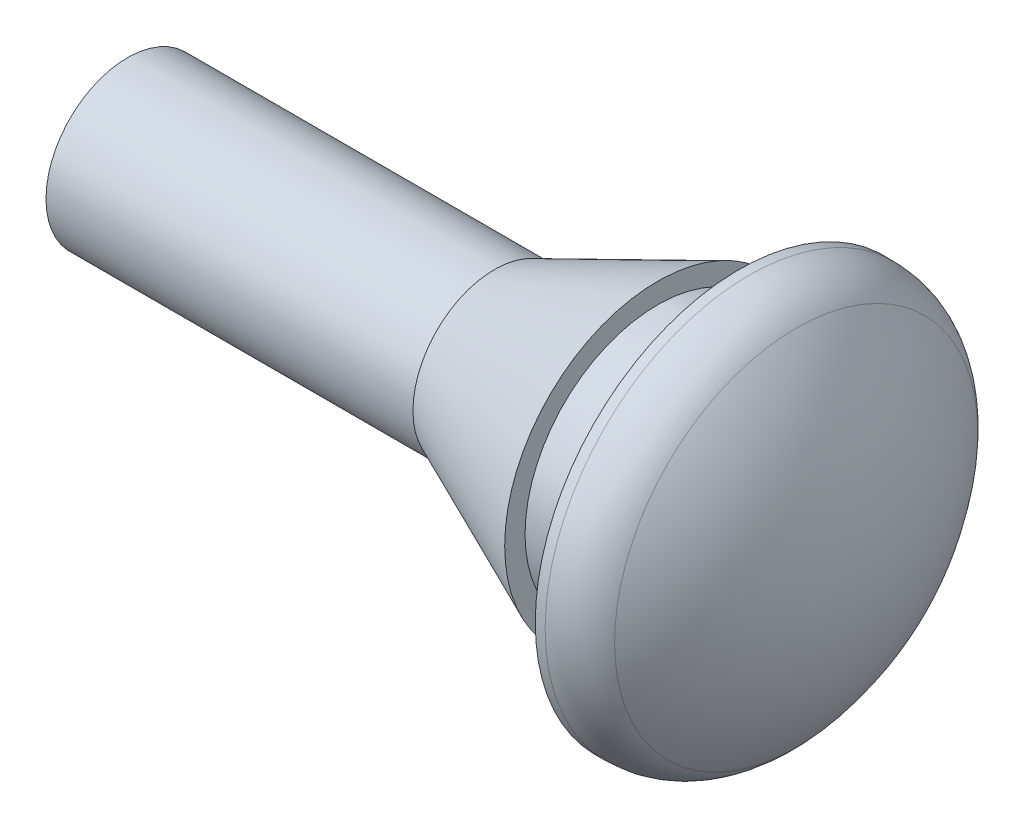
ISO-10303-21;
HEADER;
FILE_DESCRIPTION(('STEP AP214'),'2;1');
FILE_NAME('part.step','',(''),(''),'','','');
FILE_SCHEMA(('AUTOMOTIVE_DESIGN { 1 0 10303 214 1 1 1 1 }'));
ENDSEC;
DATA;
#1=APPLICATION_CONTEXT('core data for automotive mechanical design processes');
#2=APPLICATION_PROTOCOL_DEFINITION('international standard','automotive_design',2000,#1);
#3=PRODUCT_CONTEXT('',#1,'mechanical');
#4=PRODUCT('Part','Part','',(#3));
#5=PRODUCT_RELATED_PRODUCT_CATEGORY('part','',(#4));
#6=PRODUCT_DEFINITION_FORMATION('','',#4);
#7=PRODUCT_DEFINITION_CONTEXT('part definition',#1,'design');
#8=PRODUCT_DEFINITION('design','',#6,#7);
#9=PRODUCT_DEFINITION_SHAPE('','',#8);
#10=(LENGTH_UNIT() NAMED_UNIT(*) SI_UNIT(.MILLI.,.METRE.));
#11=(NAMED_UNIT(*) PLANE_ANGLE_UNIT() SI_UNIT($,.RADIAN.));
#12=(NAMED_UNIT(*) SI_UNIT($,.STERADIAN.) SOLID_ANGLE_UNIT());
#13=UNCERTAINTY_MEASURE_WITH_UNIT(LENGTH_MEASURE(1.E-05),#10,'distance_accuracy_value','');
#14=(GEOMETRIC_REPRESENTATION_CONTEXT(3) GLOBAL_UNCERTAINTY_ASSIGNED_CONTEXT((#13)) GLOBAL_UNIT_ASSIGNED_CONTEXT((#10,
#11,#12)) REPRESENTATION_CONTEXT('',''));
#15=CARTESIAN_POINT('',(0.,0.,0.));
#16=DIRECTION('',(0.,0.,1.));
#17=DIRECTION('',(1.,0.,0.));
#18=AXIS2_PLACEMENT_3D('',#15,#16,#17);
#19=CARTESIAN_POINT('',(-7.,0.,0.));
#20=DIRECTION('',(-1.,0.,0.));
#21=DIRECTION('',(0.,1.,0.));
#22=AXIS2_PLACEMENT_3D('',#19,#20,#21);
#23=SPHERICAL_SURFACE('',#22,7.);
#24=CARTESIAN_POINT('',(-1.60027548912091,0.,0.));
#25=DIRECTION('',(-1.,0.,0.));
#26=DIRECTION('',(0.,0.,1.));
#27=AXIS2_PLACEMENT_3D('',#24,#25,#26);
#28=CIRCLE('',#27,4.45454545454545);
#29=CARTESIAN_POINT('',(-1.60027548912091,0.,4.45454545454545));
#30=VERTEX_POINT('',#29);
#31=EDGE_CURVE('E10',#30,#30,#28,.T.);
#32=ORIENTED_EDGE('',*,*,#31,.F.);
#33=EDGE_LOOP('',(#32));
#34=FACE_BOUND('',#33,.T.);
#35=ADVANCED_FACE('F24',(#34),#23,.T.);
#36=CARTESIAN_POINT('',(-2.75735931288072,0.,0.));
#37=DIRECTION('',(-1.,0.,0.));
#38=DIRECTION('',(0.,0.,1.));
#39=AXIS2_PLACEMENT_3D('',#36,#37,#38);
#40=TOROIDAL_SURFACE('',#39,3.5,1.5);
#41=CARTESIAN_POINT('',(-2.75735931288072,0.,0.));
#42=DIRECTION('',(-1.,0.,0.));
#43=DIRECTION('',(0.,0.,1.));
#44=AXIS2_PLACEMENT_3D('',#41,#42,#43);
#45=CIRCLE('',#44,5.);
#46=CARTESIAN_POINT('',(-2.75735931288072,0.,5.));
#47=VERTEX_POINT('',#46);
#48=EDGE_CURVE('E30',#47,#47,#45,.T.);
#49=ORIENTED_EDGE('',*,*,#48,.F.);
#50=EDGE_LOOP('',(#49));
#51=FACE_BOUND('',#50,.T.);
#52=ORIENTED_EDGE('',*,*,#31,.T.);
#53=EDGE_LOOP('',(#52));
#54=FACE_BOUND('',#53,.T.);
#55=ADVANCED_FACE('F90',(#51,#54),#40,.T.);
#56=CARTESIAN_POINT('',(0.,0.,0.));
#57=DIRECTION('',(-1.,0.,0.));
#58=DIRECTION('',(0.,0.,1.));
#59=AXIS2_PLACEMENT_3D('',#56,#57,#58);
#60=CYLINDRICAL_SURFACE('',#59,5.);
#61=CARTESIAN_POINT('',(-3.,0.,0.));
#62=DIRECTION('',(-1.,0.,0.));
#63=DIRECTION('',(0.,0.,1.));
#64=AXIS2_PLACEMENT_3D('',#61,#62,#63);
#65=CIRCLE('',#64,5.);
#66=CARTESIAN_POINT('',(-3.,0.,5.));
#67=VERTEX_POINT('',#66);
#68=EDGE_CURVE('E34',#67,#67,#65,.T.);
#69=ORIENTED_EDGE('',*,*,#68,.F.);
#70=EDGE_LOOP('',(#69));
#71=FACE_BOUND('',#70,.T.);
#72=ORIENTED_EDGE('',*,*,#48,.T.);
#73=EDGE_LOOP('',(#72));
#74=FACE_BOUND('',#73,.T.);
#75=ADVANCED_FACE('F85',(#71,#74),#60,.T.);
#76=CARTESIAN_POINT('',(-3.,3.25,0.));
#77=DIRECTION('',(1.,0.,0.));
#78=DIRECTION('',(0.,0.,-1.));
#79=AXIS2_PLACEMENT_3D('',#76,#77,#78);
#80=PLANE('',#79);
#81=CARTESIAN_POINT('',(-3.,0.,0.));
#82=DIRECTION('',(-1.,0.,0.));
#83=DIRECTION('',(0.,0.,1.));
#84=AXIS2_PLACEMENT_3D('',#81,#82,#83);
#85=CIRCLE('',#84,3.25);
#86=CARTESIAN_POINT('',(-3.,0.,3.25));
#87=VERTEX_POINT('',#86);
#88=EDGE_CURVE('E38',#87,#87,#85,.T.);
#89=ORIENTED_EDGE('',*,*,#88,.F.);
#90=EDGE_LOOP('',(#89));
#91=FACE_BOUND('',#90,.T.);
#92=ORIENTED_EDGE('',*,*,#68,.T.);
#93=EDGE_LOOP('',(#92));
#94=FACE_BOUND('',#93,.T.);
#95=ADVANCED_FACE('F79',(#91,#94),#80,.F.);
#96=CARTESIAN_POINT('',(0.,0.,0.));
#97=DIRECTION('',(-1.,0.,0.));
#98=DIRECTION('',(0.,0.,1.));
#99=AXIS2_PLACEMENT_3D('',#96,#97,#98);
#100=CYLINDRICAL_SURFACE('',#99,3.25);
#101=CARTESIAN_POINT('',(-5.,0.,0.));
#102=DIRECTION('',(-1.,0.,0.));
#103=DIRECTION('',(0.,0.,1.));
#104=AXIS2_PLACEMENT_3D('',#101,#102,#103);
#105=CIRCLE('',#104,3.25);
#106=CARTESIAN_POINT('',(-5.,0.,3.25));
#107=VERTEX_POINT('',#106);
#108=EDGE_CURVE('E43',#107,#107,#105,.T.);
#109=ORIENTED_EDGE('',*,*,#108,.F.);
#110=EDGE_LOOP('',(#109));
#111=FACE_BOUND('',#110,.T.);
#112=ORIENTED_EDGE('',*,*,#88,.T.);
#113=EDGE_LOOP('',(#112));
#114=FACE_BOUND('',#113,.T.);
#115=ADVANCED_FACE('F73',(#111,#114),#100,.T.);
#116=CARTESIAN_POINT('',(-5.,3.75,0.));
#117=DIRECTION('',(-1.,0.,0.));
#118=DIRECTION('',(0.,0.,1.));
#119=AXIS2_PLACEMENT_3D('',#116,#117,#118);
#120=PLANE('',#119);
#121=CARTESIAN_POINT('',(-5.,0.,0.));
#122=DIRECTION('',(-1.,0.,0.));
#123=DIRECTION('',(0.,0.,1.));
#124=AXIS2_PLACEMENT_3D('',#121,#122,#123);
#125=CIRCLE('',#124,3.75);
#126=CARTESIAN_POINT('',(-5.,0.,3.75));
#127=VERTEX_POINT('',#126);
#128=EDGE_CURVE('E46',#127,#127,#125,.T.);
#129=ORIENTED_EDGE('',*,*,#128,.F.);
#130=EDGE_LOOP('',(#129));
#131=FACE_BOUND('',#130,.T.);
#132=ORIENTED_EDGE('',*,*,#108,.T.);
#133=EDGE_LOOP('',(#132));
#134=FACE_BOUND('',#133,.T.);
#135=ADVANCED_FACE('F67',(#131,#134),#120,.F.);
#136=CARTESIAN_POINT('',(-5.,0.,0.));
#137=DIRECTION('',(1.,0.,0.));
#138=DIRECTION('',(0.,0.,-1.));
#139=AXIS2_PLACEMENT_3D('',#136,#137,#138);
#140=CONICAL_SURFACE('',#139,3.75,0.412410441597387);
#141=CARTESIAN_POINT('',(-9.,0.,0.));
#142=DIRECTION('',(-1.,0.,0.));
#143=DIRECTION('',(0.,0.,1.));
#144=AXIS2_PLACEMENT_3D('',#141,#142,#143);
#145=CIRCLE('',#144,2.);
#146=CARTESIAN_POINT('',(-9.,0.,2.));
#147=VERTEX_POINT('',#146);
#148=EDGE_CURVE('E49',#147,#147,#145,.T.);
#149=ORIENTED_EDGE('',*,*,#148,.F.);
#150=EDGE_LOOP('',(#149));
#151=FACE_BOUND('',#150,.T.);
#152=ORIENTED_EDGE('',*,*,#128,.T.);
#153=EDGE_LOOP('',(#152));
#154=FACE_BOUND('',#153,.T.);
#155=ADVANCED_FACE('F61',(#151,#154),#140,.T.);
#156=CARTESIAN_POINT('',(0.,0.,0.));
#157=DIRECTION('',(-1.,0.,0.));
#158=DIRECTION('',(0.,0.,1.));
#159=AXIS2_PLACEMENT_3D('',#156,#157,#158);
#160=CYLINDRICAL_SURFACE('',#159,2.);
#161=CARTESIAN_POINT('',(-18.,0.,0.));
#162=DIRECTION('',(-1.,0.,0.));
#163=DIRECTION('',(0.,0.,1.));
#164=AXIS2_PLACEMENT_3D('',#161,#162,#163);
#165=CIRCLE('',#164,2.);
#166=CARTESIAN_POINT('',(-18.,0.,2.));
#167=VERTEX_POINT('',#166);
#168=EDGE_CURVE('E52',#167,#167,#165,.T.);
#169=ORIENTED_EDGE('',*,*,#168,.F.);
#170=EDGE_LOOP('',(#169));
#171=FACE_BOUND('',#170,.T.);
#172=ORIENTED_EDGE('',*,*,#148,.T.);
#173=EDGE_LOOP('',(#172));
#174=FACE_BOUND('',#173,.T.);
#175=ADVANCED_FACE('F58',(#171,#174),#160,.T.);
#176=CARTESIAN_POINT('',(-18.,0.,0.));
#177=DIRECTION('',(1.,0.,0.));
#178=DIRECTION('',(0.,0.,-1.));
#179=AXIS2_PLACEMENT_3D('',#176,#177,#178);
#180=PLANE('',#179);
#181=ORIENTED_EDGE('',*,*,#168,.T.);
#182=EDGE_LOOP('',(#181));
#183=FACE_BOUND('',#182,.T.);
#184=ADVANCED_FACE('F56',(#183),#180,.F.);
#185=CLOSED_SHELL('',(#35,#55,#75,#95,#115,#135,#155,#175,#184));
#186=MANIFOLD_SOLID_BREP('B2',#185);
#187=ADVANCED_BREP_SHAPE_REPRESENTATION('',(#18,#186),#14);
#188=SHAPE_DEFINITION_REPRESENTATION(#9,#187);
ENDSEC;
END-ISO-10303-21;
